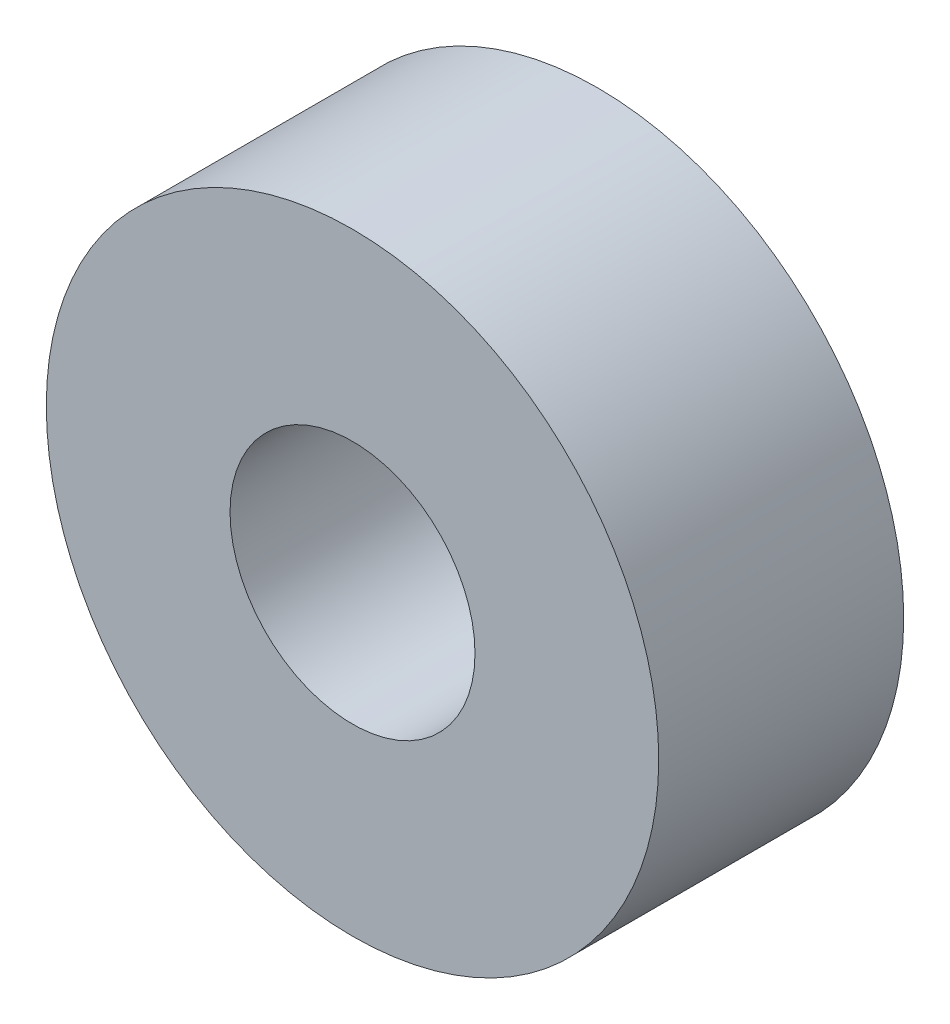
ISO-10303-21;
HEADER;
FILE_DESCRIPTION(('STEP AP214'),'2;1');
FILE_NAME('part.step','',(''),(''),'','','');
FILE_SCHEMA(('AUTOMOTIVE_DESIGN { 1 0 10303 214 1 1 1 1 }'));
ENDSEC;
DATA;
#1=APPLICATION_CONTEXT('core data for automotive mechanical design processes');
#2=APPLICATION_PROTOCOL_DEFINITION('international standard','automotive_design',2000,#1);
#3=PRODUCT_CONTEXT('',#1,'mechanical');
#4=PRODUCT('Part','Part','',(#3));
#5=PRODUCT_RELATED_PRODUCT_CATEGORY('part','',(#4));
#6=PRODUCT_DEFINITION_FORMATION('','',#4);
#7=PRODUCT_DEFINITION_CONTEXT('part definition',#1,'design');
#8=PRODUCT_DEFINITION('design','',#6,#7);
#9=PRODUCT_DEFINITION_SHAPE('','',#8);
#10=(LENGTH_UNIT() NAMED_UNIT(*) SI_UNIT(.MILLI.,.METRE.));
#11=(NAMED_UNIT(*) PLANE_ANGLE_UNIT() SI_UNIT($,.RADIAN.));
#12=(NAMED_UNIT(*) SI_UNIT($,.STERADIAN.) SOLID_ANGLE_UNIT());
#13=UNCERTAINTY_MEASURE_WITH_UNIT(LENGTH_MEASURE(1.E-05),#10,'distance_accuracy_value','');
#14=(GEOMETRIC_REPRESENTATION_CONTEXT(3) GLOBAL_UNCERTAINTY_ASSIGNED_CONTEXT((#13)) GLOBAL_UNIT_ASSIGNED_CONTEXT((#10,
#11,#12)) REPRESENTATION_CONTEXT('',''));
#15=CARTESIAN_POINT('',(0.,0.,0.));
#16=DIRECTION('',(0.,0.,1.));
#17=DIRECTION('',(1.,0.,0.));
#18=AXIS2_PLACEMENT_3D('',#15,#16,#17);
#19=CARTESIAN_POINT('',(0.,0.,4.));
#20=DIRECTION('',(0.,0.,1.));
#21=DIRECTION('',(1.,0.,0.));
#22=AXIS2_PLACEMENT_3D('',#19,#20,#21);
#23=PLANE('',#22);
#24=CARTESIAN_POINT('',(0.,0.,4.));
#25=DIRECTION('',(0.,0.,1.));
#26=DIRECTION('',(1.,0.,0.));
#27=AXIS2_PLACEMENT_3D('',#24,#25,#26);
#28=CIRCLE('',#27,5.);
#29=CARTESIAN_POINT('',(5.,0.,4.));
#30=VERTEX_POINT('',#29);
#31=EDGE_CURVE('E10',#30,#30,#28,.T.);
#32=ORIENTED_EDGE('',*,*,#31,.T.);
#33=EDGE_LOOP('',(#32));
#34=FACE_BOUND('',#33,.T.);
#35=CARTESIAN_POINT('',(0.,0.,4.));
#36=DIRECTION('',(0.,0.,1.));
#37=DIRECTION('',(1.,0.,0.));
#38=AXIS2_PLACEMENT_3D('',#35,#36,#37);
#39=CIRCLE('',#38,2.);
#40=CARTESIAN_POINT('',(2.,0.,4.));
#41=VERTEX_POINT('',#40);
#42=EDGE_CURVE('E46',#41,#41,#39,.T.);
#43=ORIENTED_EDGE('',*,*,#42,.F.);
#44=EDGE_LOOP('',(#43));
#45=FACE_BOUND('',#44,.T.);
#46=ADVANCED_FACE('F35',(#34,#45),#23,.T.);
#47=CARTESIAN_POINT('',(0.,0.,0.));
#48=DIRECTION('',(0.,0.,1.));
#49=DIRECTION('',(1.,0.,0.));
#50=AXIS2_PLACEMENT_3D('',#47,#48,#49);
#51=PLANE('',#50);
#52=CARTESIAN_POINT('',(0.,0.,0.));
#53=DIRECTION('',(0.,0.,1.));
#54=DIRECTION('',(1.,0.,0.));
#55=AXIS2_PLACEMENT_3D('',#52,#53,#54);
#56=CIRCLE('',#55,5.);
#57=CARTESIAN_POINT('',(5.,0.,0.));
#58=VERTEX_POINT('',#57);
#59=EDGE_CURVE('E39',#58,#58,#56,.T.);
#60=ORIENTED_EDGE('',*,*,#59,.F.);
#61=EDGE_LOOP('',(#60));
#62=FACE_BOUND('',#61,.T.);
#63=CARTESIAN_POINT('',(0.,0.,0.));
#64=DIRECTION('',(0.,0.,1.));
#65=DIRECTION('',(1.,0.,0.));
#66=AXIS2_PLACEMENT_3D('',#63,#64,#65);
#67=CIRCLE('',#66,2.);
#68=CARTESIAN_POINT('',(2.,0.,0.));
#69=VERTEX_POINT('',#68);
#70=EDGE_CURVE('E48',#69,#69,#67,.T.);
#71=ORIENTED_EDGE('',*,*,#70,.T.);
#72=EDGE_LOOP('',(#71));
#73=FACE_BOUND('',#72,.T.);
#74=ADVANCED_FACE('F58',(#62,#73),#51,.F.);
#75=CARTESIAN_POINT('',(0.,0.,4.));
#76=DIRECTION('',(0.,0.,-1.));
#77=DIRECTION('',(-1.,0.,0.));
#78=AXIS2_PLACEMENT_3D('',#75,#76,#77);
#79=CYLINDRICAL_SURFACE('',#78,5.);
#80=ORIENTED_EDGE('',*,*,#31,.F.);
#81=EDGE_LOOP('',(#80));
#82=FACE_BOUND('',#81,.T.);
#83=ORIENTED_EDGE('',*,*,#59,.T.);
#84=EDGE_LOOP('',(#83));
#85=FACE_BOUND('',#84,.T.);
#86=ADVANCED_FACE('F37',(#82,#85),#79,.T.);
#87=CARTESIAN_POINT('',(0.,0.,4.));
#88=DIRECTION('',(0.,0.,-1.));
#89=DIRECTION('',(-1.,0.,0.));
#90=AXIS2_PLACEMENT_3D('',#87,#88,#89);
#91=CYLINDRICAL_SURFACE('',#90,2.);
#92=ORIENTED_EDGE('',*,*,#42,.T.);
#93=EDGE_LOOP('',(#92));
#94=FACE_BOUND('',#93,.T.);
#95=ORIENTED_EDGE('',*,*,#70,.F.);
#96=EDGE_LOOP('',(#95));
#97=FACE_BOUND('',#96,.T.);
#98=ADVANCED_FACE('F54',(#94,#97),#91,.F.);
#99=CLOSED_SHELL('',(#46,#74,#86,#98));
#100=MANIFOLD_SOLID_BREP('B2',#99);
#101=ADVANCED_BREP_SHAPE_REPRESENTATION('',(#18,#100),#14);
#102=SHAPE_DEFINITION_REPRESENTATION(#9,#101);
ENDSEC;
END-ISO-10303-21;
